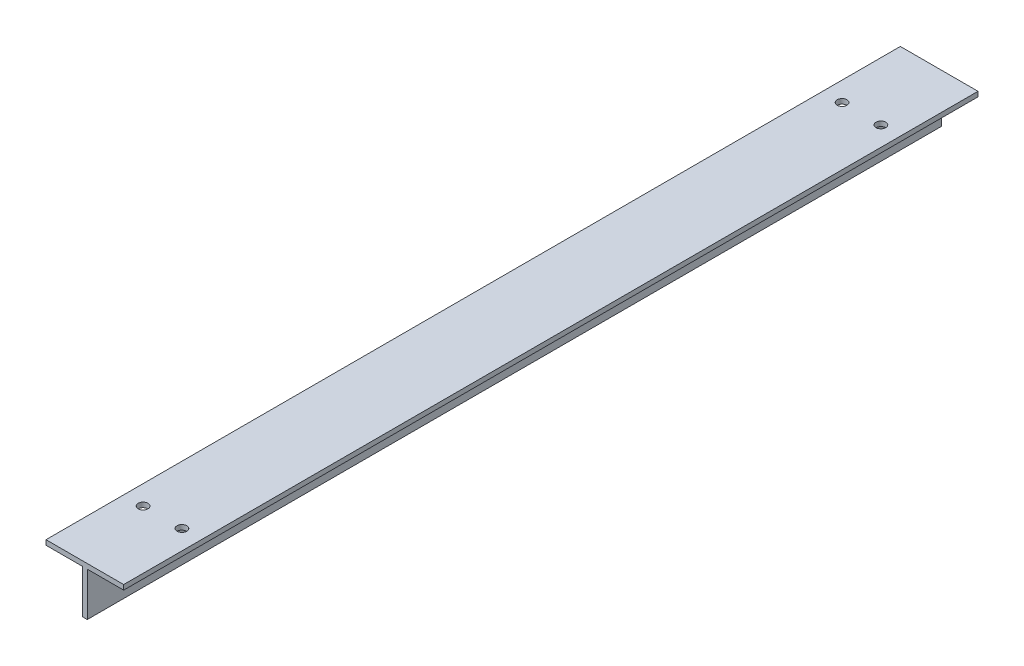
ISO-10303-21;
HEADER;
FILE_DESCRIPTION(('STEP AP214'),'2;1');
FILE_NAME('part.step','',(''),(''),'','','');
FILE_SCHEMA(('AUTOMOTIVE_DESIGN { 1 0 10303 214 1 1 1 1 }'));
ENDSEC;
DATA;
#1=APPLICATION_CONTEXT('core data for automotive mechanical design processes');
#2=APPLICATION_PROTOCOL_DEFINITION('international standard','automotive_design',2000,#1);
#3=PRODUCT_CONTEXT('',#1,'mechanical');
#4=PRODUCT('Part','Part','',(#3));
#5=PRODUCT_RELATED_PRODUCT_CATEGORY('part','',(#4));
#6=PRODUCT_DEFINITION_FORMATION('','',#4);
#7=PRODUCT_DEFINITION_CONTEXT('part definition',#1,'design');
#8=PRODUCT_DEFINITION('design','',#6,#7);
#9=PRODUCT_DEFINITION_SHAPE('','',#8);
#10=(LENGTH_UNIT() NAMED_UNIT(*) SI_UNIT(.MILLI.,.METRE.));
#11=(NAMED_UNIT(*) PLANE_ANGLE_UNIT() SI_UNIT($,.RADIAN.));
#12=(NAMED_UNIT(*) SI_UNIT($,.STERADIAN.) SOLID_ANGLE_UNIT());
#13=UNCERTAINTY_MEASURE_WITH_UNIT(LENGTH_MEASURE(1.E-05),#10,'distance_accuracy_value','');
#14=(GEOMETRIC_REPRESENTATION_CONTEXT(3) GLOBAL_UNCERTAINTY_ASSIGNED_CONTEXT((#13)) GLOBAL_UNIT_ASSIGNED_CONTEXT((#10,
#11,#12)) REPRESENTATION_CONTEXT('',''));
#15=CARTESIAN_POINT('',(0.,0.,0.));
#16=DIRECTION('',(0.,0.,1.));
#17=DIRECTION('',(1.,0.,0.));
#18=AXIS2_PLACEMENT_3D('',#15,#16,#17);
#19=CARTESIAN_POINT('',(25.4,31.75,279.4));
#20=DIRECTION('',(0.,-1.,0.));
#21=DIRECTION('',(0.,0.,-1.));
#22=AXIS2_PLACEMENT_3D('',#19,#20,#21);
#23=PLANE('',#22);
#24=CARTESIAN_POINT('',(-12.6999999999999,31.75,228.6));
#25=DIRECTION('',(0.,1.,0.));
#26=DIRECTION('',(0.,0.,-1.));
#27=AXIS2_PLACEMENT_3D('',#24,#25,#26);
#28=CIRCLE('',#27,3.175);
#29=CARTESIAN_POINT('',(-12.6999999999999,31.75,225.425));
#30=VERTEX_POINT('',#29);
#31=EDGE_CURVE('E269',#30,#30,#28,.T.);
#32=ORIENTED_EDGE('',*,*,#31,.F.);
#33=EDGE_LOOP('',(#32));
#34=FACE_BOUND('',#33,.T.);
#35=CARTESIAN_POINT('',(12.7000000000001,31.75,228.6));
#36=DIRECTION('',(0.,1.,0.));
#37=DIRECTION('',(0.,0.,1.));
#38=AXIS2_PLACEMENT_3D('',#35,#36,#37);
#39=CIRCLE('',#38,3.175);
#40=CARTESIAN_POINT('',(12.7000000000001,31.75,231.775));
#41=VERTEX_POINT('',#40);
#42=EDGE_CURVE('E273',#41,#41,#39,.T.);
#43=ORIENTED_EDGE('',*,*,#42,.F.);
#44=EDGE_LOOP('',(#43));
#45=FACE_BOUND('',#44,.T.);
#46=CARTESIAN_POINT('',(12.7,31.75,-228.6));
#47=DIRECTION('',(0.,1.,0.));
#48=DIRECTION('',(0.,0.,-1.));
#49=AXIS2_PLACEMENT_3D('',#46,#47,#48);
#50=CIRCLE('',#49,3.175);
#51=CARTESIAN_POINT('',(12.7,31.75,-231.775));
#52=VERTEX_POINT('',#51);
#53=EDGE_CURVE('E277',#52,#52,#50,.T.);
#54=ORIENTED_EDGE('',*,*,#53,.F.);
#55=EDGE_LOOP('',(#54));
#56=FACE_BOUND('',#55,.T.);
#57=CARTESIAN_POINT('',(-12.7,31.75,-228.6));
#58=DIRECTION('',(0.,1.,0.));
#59=DIRECTION('',(0.,0.,1.));
#60=AXIS2_PLACEMENT_3D('',#57,#58,#59);
#61=CIRCLE('',#60,3.175);
#62=CARTESIAN_POINT('',(-12.7,31.75,-225.425));
#63=VERTEX_POINT('',#62);
#64=EDGE_CURVE('E190',#63,#63,#61,.T.);
#65=ORIENTED_EDGE('',*,*,#64,.F.);
#66=EDGE_LOOP('',(#65));
#67=FACE_BOUND('',#66,.T.);
#68=DIRECTION('',(-1.,0.,0.));
#69=VECTOR('',#68,1.);
#70=CARTESIAN_POINT('',(25.4,31.75,-279.4));
#71=LINE('',#70,#69);
#72=CARTESIAN_POINT('',(25.4,31.75,-279.4));
#73=VERTEX_POINT('',#72);
#74=CARTESIAN_POINT('',(-25.4,31.75,-279.4));
#75=VERTEX_POINT('',#74);
#76=EDGE_CURVE('E144',#73,#75,#71,.T.);
#77=ORIENTED_EDGE('',*,*,#76,.T.);
#78=DIRECTION('',(0.,0.,-1.));
#79=VECTOR('',#78,1.);
#80=CARTESIAN_POINT('',(-25.4,31.75,279.4));
#81=LINE('',#80,#79);
#82=CARTESIAN_POINT('',(-25.4,31.75,279.4));
#83=VERTEX_POINT('',#82);
#84=EDGE_CURVE('E11',#83,#75,#81,.T.);
#85=ORIENTED_EDGE('',*,*,#84,.F.);
#86=DIRECTION('',(-1.,0.,0.));
#87=VECTOR('',#86,1.);
#88=CARTESIAN_POINT('',(25.4,31.75,279.4));
#89=LINE('',#88,#87);
#90=CARTESIAN_POINT('',(25.4,31.75,279.4));
#91=VERTEX_POINT('',#90);
#92=EDGE_CURVE('E167',#91,#83,#89,.T.);
#93=ORIENTED_EDGE('',*,*,#92,.F.);
#94=DIRECTION('',(0.,0.,-1.));
#95=VECTOR('',#94,1.);
#96=CARTESIAN_POINT('',(25.4,31.75,279.4));
#97=LINE('',#96,#95);
#98=EDGE_CURVE('E140',#91,#73,#97,.T.);
#99=ORIENTED_EDGE('',*,*,#98,.T.);
#100=EDGE_LOOP('',(#77,#85,#93,#99));
#101=FACE_BOUND('',#100,.T.);
#102=ADVANCED_FACE('F41',(#34,#45,#56,#67,#101),#23,.F.);
#103=CARTESIAN_POINT('',(-25.4,31.75,279.4));
#104=DIRECTION('',(1.,0.,0.));
#105=DIRECTION('',(0.,1.,0.));
#106=AXIS2_PLACEMENT_3D('',#103,#104,#105);
#107=PLANE('',#106);
#108=DIRECTION('',(0.,-1.,0.));
#109=VECTOR('',#108,1.);
#110=CARTESIAN_POINT('',(-25.4,31.75,-279.4));
#111=LINE('',#110,#109);
#112=CARTESIAN_POINT('',(-25.4,28.575,-279.4));
#113=VERTEX_POINT('',#112);
#114=EDGE_CURVE('E148',#75,#113,#111,.T.);
#115=ORIENTED_EDGE('',*,*,#114,.T.);
#116=DIRECTION('',(0.,0.,-1.));
#117=VECTOR('',#116,1.);
#118=CARTESIAN_POINT('',(-25.4,28.575,279.4));
#119=LINE('',#118,#117);
#120=CARTESIAN_POINT('',(-25.4,28.575,279.4));
#121=VERTEX_POINT('',#120);
#122=EDGE_CURVE('E51',#121,#113,#119,.T.);
#123=ORIENTED_EDGE('',*,*,#122,.F.);
#124=DIRECTION('',(0.,-1.,0.));
#125=VECTOR('',#124,1.);
#126=CARTESIAN_POINT('',(-25.4,31.75,279.4));
#127=LINE('',#126,#125);
#128=EDGE_CURVE('E103',#83,#121,#127,.T.);
#129=ORIENTED_EDGE('',*,*,#128,.F.);
#130=ORIENTED_EDGE('',*,*,#84,.T.);
#131=EDGE_LOOP('',(#115,#123,#129,#130));
#132=FACE_BOUND('',#131,.T.);
#133=ADVANCED_FACE('F260',(#132),#107,.F.);
#134=CARTESIAN_POINT('',(-25.4,28.575,279.4));
#135=DIRECTION('',(0.,1.,0.));
#136=DIRECTION('',(0.,0.,1.));
#137=AXIS2_PLACEMENT_3D('',#134,#135,#136);
#138=PLANE('',#137);
#139=CARTESIAN_POINT('',(-12.6999999999999,28.575,228.6));
#140=DIRECTION('',(0.,1.,0.));
#141=DIRECTION('',(0.,0.,1.));
#142=AXIS2_PLACEMENT_3D('',#139,#140,#141);
#143=CIRCLE('',#142,3.175);
#144=CARTESIAN_POINT('',(-12.6999999999999,28.575,231.775));
#145=VERTEX_POINT('',#144);
#146=EDGE_CURVE('E44',#145,#145,#143,.T.);
#147=ORIENTED_EDGE('',*,*,#146,.T.);
#148=EDGE_LOOP('',(#147));
#149=FACE_BOUND('',#148,.T.);
#150=CARTESIAN_POINT('',(-12.7,28.575,-228.6));
#151=DIRECTION('',(0.,1.,0.));
#152=DIRECTION('',(0.,0.,1.));
#153=AXIS2_PLACEMENT_3D('',#150,#151,#152);
#154=CIRCLE('',#153,3.175);
#155=CARTESIAN_POINT('',(-12.7,28.575,-225.425));
#156=VERTEX_POINT('',#155);
#157=EDGE_CURVE('E193',#156,#156,#154,.T.);
#158=ORIENTED_EDGE('',*,*,#157,.T.);
#159=EDGE_LOOP('',(#158));
#160=FACE_BOUND('',#159,.T.);
#161=DIRECTION('',(1.,0.,0.));
#162=VECTOR('',#161,1.);
#163=CARTESIAN_POINT('',(-25.4,28.575,-279.4));
#164=LINE('',#163,#162);
#165=CARTESIAN_POINT('',(-1.58750000000001,28.575,-279.4));
#166=VERTEX_POINT('',#165);
#167=EDGE_CURVE('E152',#113,#166,#164,.T.);
#168=ORIENTED_EDGE('',*,*,#167,.T.);
#169=DIRECTION('',(0.,0.,-1.));
#170=VECTOR('',#169,1.);
#171=CARTESIAN_POINT('',(-1.58750000000001,28.575,279.4));
#172=LINE('',#171,#170);
#173=CARTESIAN_POINT('',(-1.58750000000001,28.575,279.4));
#174=VERTEX_POINT('',#173);
#175=EDGE_CURVE('E178',#174,#166,#172,.T.);
#176=ORIENTED_EDGE('',*,*,#175,.F.);
#177=DIRECTION('',(1.,0.,0.));
#178=VECTOR('',#177,1.);
#179=CARTESIAN_POINT('',(-25.4,28.575,279.4));
#180=LINE('',#179,#178);
#181=EDGE_CURVE('E225',#121,#174,#180,.T.);
#182=ORIENTED_EDGE('',*,*,#181,.F.);
#183=ORIENTED_EDGE('',*,*,#122,.T.);
#184=EDGE_LOOP('',(#168,#176,#182,#183));
#185=FACE_BOUND('',#184,.T.);
#186=ADVANCED_FACE('F265',(#149,#160,#185),#138,.F.);
#187=CARTESIAN_POINT('',(-1.58750000000001,28.575,279.4));
#188=DIRECTION('',(1.,0.,0.));
#189=DIRECTION('',(0.,1.,0.));
#190=AXIS2_PLACEMENT_3D('',#187,#188,#189);
#191=PLANE('',#190);
#192=CARTESIAN_POINT('',(-1.5875,15.875,254.));
#193=DIRECTION('',(1.,0.,0.));
#194=DIRECTION('',(0.,1.,0.));
#195=AXIS2_PLACEMENT_3D('',#192,#193,#194);
#196=CIRCLE('',#195,3.49999999999996);
#197=CARTESIAN_POINT('',(-1.5875,19.375,254.));
#198=VERTEX_POINT('',#197);
#199=EDGE_CURVE('E149',#198,#198,#196,.T.);
#200=ORIENTED_EDGE('',*,*,#199,.T.);
#201=EDGE_LOOP('',(#200));
#202=FACE_BOUND('',#201,.T.);
#203=CARTESIAN_POINT('',(-1.5875,15.875,-254.));
#204=DIRECTION('',(1.,0.,0.));
#205=DIRECTION('',(0.,1.,0.));
#206=AXIS2_PLACEMENT_3D('',#203,#204,#205);
#207=CIRCLE('',#206,3.50000000000002);
#208=CARTESIAN_POINT('',(-1.5875,19.375,-254.));
#209=VERTEX_POINT('',#208);
#210=EDGE_CURVE('E211',#209,#209,#207,.T.);
#211=ORIENTED_EDGE('',*,*,#210,.T.);
#212=EDGE_LOOP('',(#211));
#213=FACE_BOUND('',#212,.T.);
#214=DIRECTION('',(0.,-1.,0.));
#215=VECTOR('',#214,1.);
#216=CARTESIAN_POINT('',(-1.58750000000001,28.575,-279.4));
#217=LINE('',#216,#215);
#218=CARTESIAN_POINT('',(-1.5875,0.,-279.4));
#219=VERTEX_POINT('',#218);
#220=EDGE_CURVE('E155',#166,#219,#217,.T.);
#221=ORIENTED_EDGE('',*,*,#220,.T.);
#222=DIRECTION('',(0.,0.,-1.));
#223=VECTOR('',#222,1.);
#224=CARTESIAN_POINT('',(-1.5875,0.,279.4));
#225=LINE('',#224,#223);
#226=CARTESIAN_POINT('',(-1.5875,0.,279.4));
#227=VERTEX_POINT('',#226);
#228=EDGE_CURVE('E174',#227,#219,#225,.T.);
#229=ORIENTED_EDGE('',*,*,#228,.F.);
#230=DIRECTION('',(0.,-1.,0.));
#231=VECTOR('',#230,1.);
#232=CARTESIAN_POINT('',(-1.58750000000001,28.575,279.4));
#233=LINE('',#232,#231);
#234=EDGE_CURVE('E228',#174,#227,#233,.T.);
#235=ORIENTED_EDGE('',*,*,#234,.F.);
#236=ORIENTED_EDGE('',*,*,#175,.T.);
#237=EDGE_LOOP('',(#221,#229,#235,#236));
#238=FACE_BOUND('',#237,.T.);
#239=ADVANCED_FACE('F236',(#202,#213,#238),#191,.F.);
#240=CARTESIAN_POINT('',(-1.5875,0.,279.4));
#241=DIRECTION('',(0.,1.,0.));
#242=DIRECTION('',(0.,0.,1.));
#243=AXIS2_PLACEMENT_3D('',#240,#241,#242);
#244=PLANE('',#243);
#245=DIRECTION('',(1.,0.,0.));
#246=VECTOR('',#245,1.);
#247=CARTESIAN_POINT('',(-1.5875,0.,-279.4));
#248=LINE('',#247,#246);
#249=CARTESIAN_POINT('',(1.5875,0.,-279.4));
#250=VERTEX_POINT('',#249);
#251=EDGE_CURVE('E158',#219,#250,#248,.T.);
#252=ORIENTED_EDGE('',*,*,#251,.T.);
#253=DIRECTION('',(0.,0.,-1.));
#254=VECTOR('',#253,1.);
#255=CARTESIAN_POINT('',(1.5875,0.,279.4));
#256=LINE('',#255,#254);
#257=CARTESIAN_POINT('',(1.5875,0.,279.4));
#258=VERTEX_POINT('',#257);
#259=EDGE_CURVE('E133',#258,#250,#256,.T.);
#260=ORIENTED_EDGE('',*,*,#259,.F.);
#261=DIRECTION('',(1.,0.,0.));
#262=VECTOR('',#261,1.);
#263=CARTESIAN_POINT('',(-1.5875,0.,279.4));
#264=LINE('',#263,#262);
#265=EDGE_CURVE('E122',#227,#258,#264,.T.);
#266=ORIENTED_EDGE('',*,*,#265,.F.);
#267=ORIENTED_EDGE('',*,*,#228,.T.);
#268=EDGE_LOOP('',(#252,#260,#266,#267));
#269=FACE_BOUND('',#268,.T.);
#270=ADVANCED_FACE('F240',(#269),#244,.F.);
#271=CARTESIAN_POINT('',(1.5875,0.,279.4));
#272=DIRECTION('',(-1.,0.,0.));
#273=DIRECTION('',(0.,-1.,0.));
#274=AXIS2_PLACEMENT_3D('',#271,#272,#273);
#275=PLANE('',#274);
#276=CARTESIAN_POINT('',(1.5875,15.875,254.));
#277=DIRECTION('',(1.,0.,0.));
#278=DIRECTION('',(0.,1.,0.));
#279=AXIS2_PLACEMENT_3D('',#276,#277,#278);
#280=CIRCLE('',#279,3.49999999999996);
#281=CARTESIAN_POINT('',(1.5875,19.375,254.));
#282=VERTEX_POINT('',#281);
#283=EDGE_CURVE('E205',#282,#282,#280,.T.);
#284=ORIENTED_EDGE('',*,*,#283,.F.);
#285=EDGE_LOOP('',(#284));
#286=FACE_BOUND('',#285,.T.);
#287=CARTESIAN_POINT('',(1.5875,15.875,-254.));
#288=DIRECTION('',(1.,0.,0.));
#289=DIRECTION('',(0.,-1.,0.));
#290=AXIS2_PLACEMENT_3D('',#287,#288,#289);
#291=CIRCLE('',#290,3.50000000000002);
#292=CARTESIAN_POINT('',(1.5875,12.375,-254.));
#293=VERTEX_POINT('',#292);
#294=EDGE_CURVE('E200',#293,#293,#291,.T.);
#295=ORIENTED_EDGE('',*,*,#294,.F.);
#296=EDGE_LOOP('',(#295));
#297=FACE_BOUND('',#296,.T.);
#298=DIRECTION('',(0.,1.,0.));
#299=VECTOR('',#298,1.);
#300=CARTESIAN_POINT('',(1.5875,0.,-279.4));
#301=LINE('',#300,#299);
#302=CARTESIAN_POINT('',(1.58750000000001,28.575,-279.4));
#303=VERTEX_POINT('',#302);
#304=EDGE_CURVE('E131',#250,#303,#301,.T.);
#305=ORIENTED_EDGE('',*,*,#304,.T.);
#306=DIRECTION('',(0.,0.,-1.));
#307=VECTOR('',#306,1.);
#308=CARTESIAN_POINT('',(1.58750000000001,28.575,279.4));
#309=LINE('',#308,#307);
#310=CARTESIAN_POINT('',(1.58750000000001,28.575,279.4));
#311=VERTEX_POINT('',#310);
#312=EDGE_CURVE('E128',#311,#303,#309,.T.);
#313=ORIENTED_EDGE('',*,*,#312,.F.);
#314=DIRECTION('',(0.,1.,0.));
#315=VECTOR('',#314,1.);
#316=CARTESIAN_POINT('',(1.5875,0.,279.4));
#317=LINE('',#316,#315);
#318=EDGE_CURVE('E116',#258,#311,#317,.T.);
#319=ORIENTED_EDGE('',*,*,#318,.F.);
#320=ORIENTED_EDGE('',*,*,#259,.T.);
#321=EDGE_LOOP('',(#305,#313,#319,#320));
#322=FACE_BOUND('',#321,.T.);
#323=ADVANCED_FACE('F129',(#286,#297,#322),#275,.F.);
#324=CARTESIAN_POINT('',(1.58750000000001,28.575,279.4));
#325=DIRECTION('',(0.,1.,0.));
#326=DIRECTION('',(0.,0.,1.));
#327=AXIS2_PLACEMENT_3D('',#324,#325,#326);
#328=PLANE('',#327);
#329=CARTESIAN_POINT('',(12.7000000000001,28.575,228.6));
#330=DIRECTION('',(0.,1.,0.));
#331=DIRECTION('',(0.,0.,1.));
#332=AXIS2_PLACEMENT_3D('',#329,#330,#331);
#333=CIRCLE('',#332,3.175);
#334=CARTESIAN_POINT('',(12.7000000000001,28.575,231.775));
#335=VERTEX_POINT('',#334);
#336=EDGE_CURVE('E189',#335,#335,#333,.T.);
#337=ORIENTED_EDGE('',*,*,#336,.T.);
#338=EDGE_LOOP('',(#337));
#339=FACE_BOUND('',#338,.T.);
#340=CARTESIAN_POINT('',(12.7,28.575,-228.6));
#341=DIRECTION('',(0.,1.,0.));
#342=DIRECTION('',(0.,0.,1.));
#343=AXIS2_PLACEMENT_3D('',#340,#341,#342);
#344=CIRCLE('',#343,3.175);
#345=CARTESIAN_POINT('',(12.7,28.575,-225.425));
#346=VERTEX_POINT('',#345);
#347=EDGE_CURVE('E185',#346,#346,#344,.T.);
#348=ORIENTED_EDGE('',*,*,#347,.T.);
#349=EDGE_LOOP('',(#348));
#350=FACE_BOUND('',#349,.T.);
#351=DIRECTION('',(1.,0.,0.));
#352=VECTOR('',#351,1.);
#353=CARTESIAN_POINT('',(1.58750000000001,28.575,-279.4));
#354=LINE('',#353,#352);
#355=CARTESIAN_POINT('',(25.4,28.575,-279.4));
#356=VERTEX_POINT('',#355);
#357=EDGE_CURVE('E89',#303,#356,#354,.T.);
#358=ORIENTED_EDGE('',*,*,#357,.T.);
#359=DIRECTION('',(0.,0.,-1.));
#360=VECTOR('',#359,1.);
#361=CARTESIAN_POINT('',(25.4,28.575,279.4));
#362=LINE('',#361,#360);
#363=CARTESIAN_POINT('',(25.4,28.575,279.4));
#364=VERTEX_POINT('',#363);
#365=EDGE_CURVE('E134',#364,#356,#362,.T.);
#366=ORIENTED_EDGE('',*,*,#365,.F.);
#367=DIRECTION('',(1.,0.,0.));
#368=VECTOR('',#367,1.);
#369=CARTESIAN_POINT('',(1.58750000000001,28.575,279.4));
#370=LINE('',#369,#368);
#371=EDGE_CURVE('E120',#311,#364,#370,.T.);
#372=ORIENTED_EDGE('',*,*,#371,.F.);
#373=ORIENTED_EDGE('',*,*,#312,.T.);
#374=EDGE_LOOP('',(#358,#366,#372,#373));
#375=FACE_BOUND('',#374,.T.);
#376=ADVANCED_FACE('F136',(#339,#350,#375),#328,.F.);
#377=CARTESIAN_POINT('',(25.4,28.575,279.4));
#378=DIRECTION('',(-1.,0.,0.));
#379=DIRECTION('',(0.,-1.,0.));
#380=AXIS2_PLACEMENT_3D('',#377,#378,#379);
#381=PLANE('',#380);
#382=DIRECTION('',(0.,1.,0.));
#383=VECTOR('',#382,1.);
#384=CARTESIAN_POINT('',(25.4,28.575,-279.4));
#385=LINE('',#384,#383);
#386=EDGE_CURVE('E95',#356,#73,#385,.T.);
#387=ORIENTED_EDGE('',*,*,#386,.T.);
#388=ORIENTED_EDGE('',*,*,#98,.F.);
#389=DIRECTION('',(0.,1.,0.));
#390=VECTOR('',#389,1.);
#391=CARTESIAN_POINT('',(25.4,28.575,279.4));
#392=LINE('',#391,#390);
#393=EDGE_CURVE('E60',#364,#91,#392,.T.);
#394=ORIENTED_EDGE('',*,*,#393,.F.);
#395=ORIENTED_EDGE('',*,*,#365,.T.);
#396=EDGE_LOOP('',(#387,#388,#394,#395));
#397=FACE_BOUND('',#396,.T.);
#398=ADVANCED_FACE('F248',(#397),#381,.F.);
#399=CARTESIAN_POINT('',(-25.4,31.75,279.4));
#400=DIRECTION('',(0.,0.,1.));
#401=DIRECTION('',(1.,0.,0.));
#402=AXIS2_PLACEMENT_3D('',#399,#400,#401);
#403=PLANE('',#402);
#404=ORIENTED_EDGE('',*,*,#92,.T.);
#405=ORIENTED_EDGE('',*,*,#128,.T.);
#406=ORIENTED_EDGE('',*,*,#181,.T.);
#407=ORIENTED_EDGE('',*,*,#234,.T.);
#408=ORIENTED_EDGE('',*,*,#265,.T.);
#409=ORIENTED_EDGE('',*,*,#318,.T.);
#410=ORIENTED_EDGE('',*,*,#371,.T.);
#411=ORIENTED_EDGE('',*,*,#393,.T.);
#412=EDGE_LOOP('',(#404,#405,#406,#407,#408,#409,#410,#411));
#413=FACE_BOUND('',#412,.T.);
#414=ADVANCED_FACE('F118',(#413),#403,.T.);
#415=CARTESIAN_POINT('',(-25.4,31.75,-279.4));
#416=DIRECTION('',(0.,0.,1.));
#417=DIRECTION('',(1.,0.,0.));
#418=AXIS2_PLACEMENT_3D('',#415,#416,#417);
#419=PLANE('',#418);
#420=ORIENTED_EDGE('',*,*,#76,.F.);
#421=ORIENTED_EDGE('',*,*,#386,.F.);
#422=ORIENTED_EDGE('',*,*,#357,.F.);
#423=ORIENTED_EDGE('',*,*,#304,.F.);
#424=ORIENTED_EDGE('',*,*,#251,.F.);
#425=ORIENTED_EDGE('',*,*,#220,.F.);
#426=ORIENTED_EDGE('',*,*,#167,.F.);
#427=ORIENTED_EDGE('',*,*,#114,.F.);
#428=EDGE_LOOP('',(#420,#421,#422,#423,#424,#425,#426,#427));
#429=FACE_BOUND('',#428,.T.);
#430=ADVANCED_FACE('F243',(#429),#419,.F.);
#431=CARTESIAN_POINT('',(-25.4,15.875,-254.));
#432=DIRECTION('',(1.,0.,0.));
#433=DIRECTION('',(0.,1.,0.));
#434=AXIS2_PLACEMENT_3D('',#431,#432,#433);
#435=CYLINDRICAL_SURFACE('',#434,3.50000000000002);
#436=ORIENTED_EDGE('',*,*,#294,.T.);
#437=EDGE_LOOP('',(#436));
#438=FACE_BOUND('',#437,.T.);
#439=ORIENTED_EDGE('',*,*,#210,.F.);
#440=EDGE_LOOP('',(#439));
#441=FACE_BOUND('',#440,.T.);
#442=ADVANCED_FACE('F306',(#438,#441),#435,.F.);
#443=CARTESIAN_POINT('',(-25.4,15.875,254.));
#444=DIRECTION('',(1.,0.,0.));
#445=DIRECTION('',(0.,1.,0.));
#446=AXIS2_PLACEMENT_3D('',#443,#444,#445);
#447=CYLINDRICAL_SURFACE('',#446,3.49999999999996);
#448=ORIENTED_EDGE('',*,*,#283,.T.);
#449=EDGE_LOOP('',(#448));
#450=FACE_BOUND('',#449,.T.);
#451=ORIENTED_EDGE('',*,*,#199,.F.);
#452=EDGE_LOOP('',(#451));
#453=FACE_BOUND('',#452,.T.);
#454=ADVANCED_FACE('F300',(#450,#453),#447,.F.);
#455=CARTESIAN_POINT('',(12.7,0.,-228.6));
#456=DIRECTION('',(0.,1.,0.));
#457=DIRECTION('',(0.,0.,1.));
#458=AXIS2_PLACEMENT_3D('',#455,#456,#457);
#459=CYLINDRICAL_SURFACE('',#458,3.175);
#460=ORIENTED_EDGE('',*,*,#53,.T.);
#461=EDGE_LOOP('',(#460));
#462=FACE_BOUND('',#461,.T.);
#463=ORIENTED_EDGE('',*,*,#347,.F.);
#464=EDGE_LOOP('',(#463));
#465=FACE_BOUND('',#464,.T.);
#466=ADVANCED_FACE('F293',(#462,#465),#459,.F.);
#467=CARTESIAN_POINT('',(12.7000000000001,0.,228.6));
#468=DIRECTION('',(0.,1.,0.));
#469=DIRECTION('',(0.,0.,1.));
#470=AXIS2_PLACEMENT_3D('',#467,#468,#469);
#471=CYLINDRICAL_SURFACE('',#470,3.175);
#472=ORIENTED_EDGE('',*,*,#42,.T.);
#473=EDGE_LOOP('',(#472));
#474=FACE_BOUND('',#473,.T.);
#475=ORIENTED_EDGE('',*,*,#336,.F.);
#476=EDGE_LOOP('',(#475));
#477=FACE_BOUND('',#476,.T.);
#478=ADVANCED_FACE('F289',(#474,#477),#471,.F.);
#479=CARTESIAN_POINT('',(-12.7,0.,-228.6));
#480=DIRECTION('',(0.,1.,0.));
#481=DIRECTION('',(0.,0.,1.));
#482=AXIS2_PLACEMENT_3D('',#479,#480,#481);
#483=CYLINDRICAL_SURFACE('',#482,3.175);
#484=ORIENTED_EDGE('',*,*,#64,.T.);
#485=EDGE_LOOP('',(#484));
#486=FACE_BOUND('',#485,.T.);
#487=ORIENTED_EDGE('',*,*,#157,.F.);
#488=EDGE_LOOP('',(#487));
#489=FACE_BOUND('',#488,.T.);
#490=ADVANCED_FACE('F292',(#486,#489),#483,.F.);
#491=CARTESIAN_POINT('',(-12.6999999999999,0.,228.6));
#492=DIRECTION('',(0.,1.,0.));
#493=DIRECTION('',(0.,0.,1.));
#494=AXIS2_PLACEMENT_3D('',#491,#492,#493);
#495=CYLINDRICAL_SURFACE('',#494,3.175);
#496=ORIENTED_EDGE('',*,*,#31,.T.);
#497=EDGE_LOOP('',(#496));
#498=FACE_BOUND('',#497,.T.);
#499=ORIENTED_EDGE('',*,*,#146,.F.);
#500=EDGE_LOOP('',(#499));
#501=FACE_BOUND('',#500,.T.);
#502=ADVANCED_FACE('F310',(#498,#501),#495,.F.);
#503=CLOSED_SHELL('',(#102,#133,#186,#239,#270,#323,#376,#398,#414,#430,#442,#454,#466,#478,
#490,#502));
#504=MANIFOLD_SOLID_BREP('B2',#503);
#505=ADVANCED_BREP_SHAPE_REPRESENTATION('',(#18,#504),#14);
#506=SHAPE_DEFINITION_REPRESENTATION(#9,#505);
ENDSEC;
END-ISO-10303-21;
